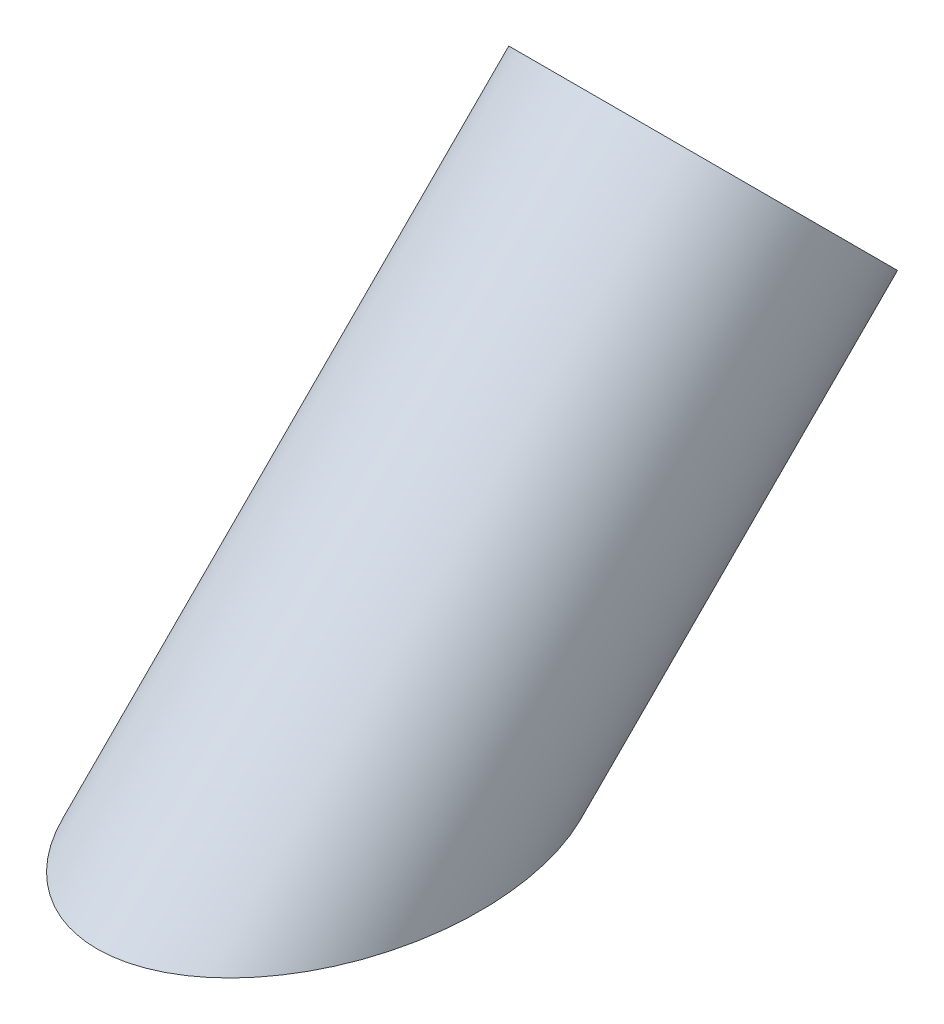
ISO-10303-21;
HEADER;
FILE_DESCRIPTION(('STEP AP214'),'2;1');
FILE_NAME('part.step','',(''),(''),'','','');
FILE_SCHEMA(('AUTOMOTIVE_DESIGN { 1 0 10303 214 1 1 1 1 }'));
ENDSEC;
DATA;
#1=APPLICATION_CONTEXT('core data for automotive mechanical design processes');
#2=APPLICATION_PROTOCOL_DEFINITION('international standard','automotive_design',2000,#1);
#3=PRODUCT_CONTEXT('',#1,'mechanical');
#4=PRODUCT('Part','Part','',(#3));
#5=PRODUCT_RELATED_PRODUCT_CATEGORY('part','',(#4));
#6=PRODUCT_DEFINITION_FORMATION('','',#4);
#7=PRODUCT_DEFINITION_CONTEXT('part definition',#1,'design');
#8=PRODUCT_DEFINITION('design','',#6,#7);
#9=PRODUCT_DEFINITION_SHAPE('','',#8);
#10=(LENGTH_UNIT() NAMED_UNIT(*) SI_UNIT(.MILLI.,.METRE.));
#11=(NAMED_UNIT(*) PLANE_ANGLE_UNIT() SI_UNIT($,.RADIAN.));
#12=(NAMED_UNIT(*) SI_UNIT($,.STERADIAN.) SOLID_ANGLE_UNIT());
#13=UNCERTAINTY_MEASURE_WITH_UNIT(LENGTH_MEASURE(1.E-05),#10,'distance_accuracy_value','');
#14=(GEOMETRIC_REPRESENTATION_CONTEXT(3) GLOBAL_UNCERTAINTY_ASSIGNED_CONTEXT((#13)) GLOBAL_UNIT_ASSIGNED_CONTEXT((#10,
#11,#12)) REPRESENTATION_CONTEXT('',''));
#15=CARTESIAN_POINT('',(0.,0.,0.));
#16=DIRECTION('',(0.,0.,1.));
#17=DIRECTION('',(1.,0.,0.));
#18=AXIS2_PLACEMENT_3D('',#15,#16,#17);
#19=CARTESIAN_POINT('',(0.,-60.3553390593273,60.3553390593279));
#20=DIRECTION('',(0.,0.707106781186544,-0.707106781186551));
#21=DIRECTION('',(0.,0.707106781186551,0.707106781186544));
#22=AXIS2_PLACEMENT_3D('',#19,#20,#21);
#23=CYLINDRICAL_SURFACE('',#22,25.);
#24=CARTESIAN_POINT('',(0.,0.,0.));
#25=DIRECTION('',(0.,1.,0.));
#26=DIRECTION('',(0.,0.,-1.));
#27=AXIS2_PLACEMENT_3D('',#24,#25,#26);
#28=ELLIPSE('',#27,35.3553390593276,25.);
#29=CARTESIAN_POINT('',(0.,0.,-35.3553390593275));
#30=VERTEX_POINT('',#29);
#31=EDGE_CURVE('E10',#30,#30,#28,.F.);
#32=ORIENTED_EDGE('',*,*,#31,.F.);
#33=EDGE_LOOP('',(#32));
#34=FACE_BOUND('',#33,.T.);
#35=CARTESIAN_POINT('',(0.,60.1040764008558,-60.1040764008564));
#36=DIRECTION('',(0.,0.707106781186544,-0.707106781186551));
#37=DIRECTION('',(0.,0.707106781186551,0.707106781186544));
#38=AXIS2_PLACEMENT_3D('',#35,#36,#37);
#39=CIRCLE('',#38,25.);
#40=CARTESIAN_POINT('',(0.,77.7817459305195,-42.4264068711928));
#41=VERTEX_POINT('',#40);
#42=EDGE_CURVE('E39',#41,#41,#39,.T.);
#43=ORIENTED_EDGE('',*,*,#42,.F.);
#44=EDGE_LOOP('',(#43));
#45=FACE_BOUND('',#44,.T.);
#46=ADVANCED_FACE('F33',(#34,#45),#23,.T.);
#47=CARTESIAN_POINT('',(0.,60.1040764008558,-60.1040764008564));
#48=DIRECTION('',(0.,0.707106781186544,-0.707106781186551));
#49=DIRECTION('',(0.,0.707106781186551,0.707106781186544));
#50=AXIS2_PLACEMENT_3D('',#47,#48,#49);
#51=PLANE('',#50);
#52=ORIENTED_EDGE('',*,*,#42,.T.);
#53=EDGE_LOOP('',(#52));
#54=FACE_BOUND('',#53,.T.);
#55=ADVANCED_FACE('F45',(#54),#51,.T.);
#56=CARTESIAN_POINT('',(0.,0.,0.));
#57=DIRECTION('',(0.,1.,0.));
#58=DIRECTION('',(0.,0.,1.));
#59=AXIS2_PLACEMENT_3D('',#56,#57,#58);
#60=PLANE('',#59);
#61=ORIENTED_EDGE('',*,*,#31,.T.);
#62=EDGE_LOOP('',(#61));
#63=FACE_BOUND('',#62,.T.);
#64=ADVANCED_FACE('F52',(#63),#60,.F.);
#65=CLOSED_SHELL('',(#46,#55,#64));
#66=MANIFOLD_SOLID_BREP('B2',#65);
#67=ADVANCED_BREP_SHAPE_REPRESENTATION('',(#18,#66),#14);
#68=SHAPE_DEFINITION_REPRESENTATION(#9,#67);
ENDSEC;
END-ISO-10303-21;
